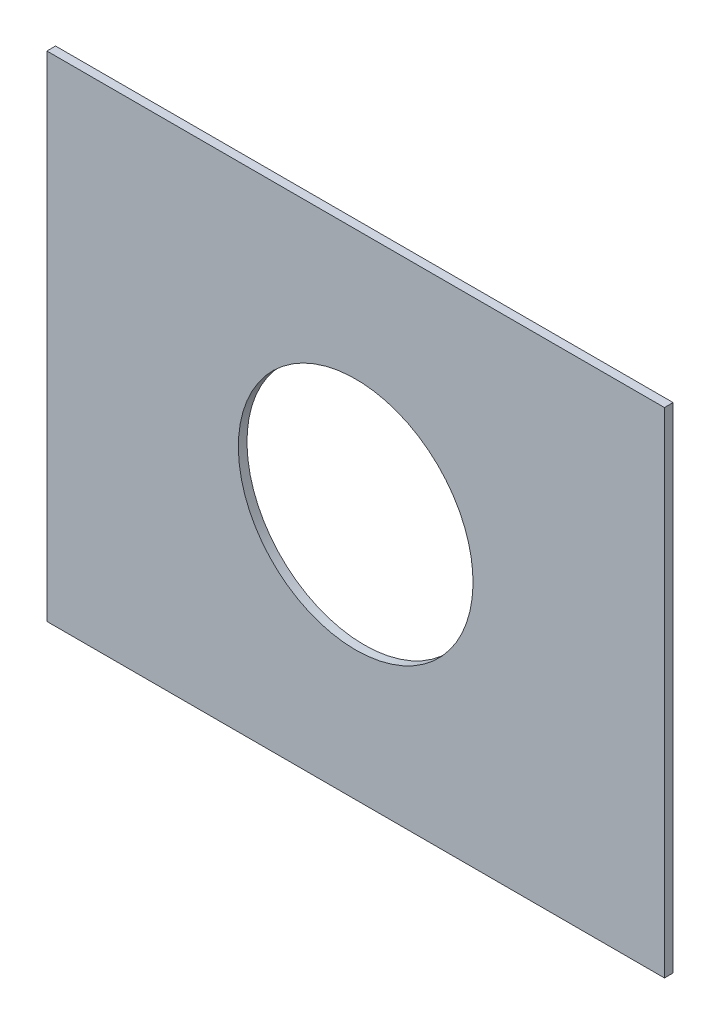
ISO-10303-21;
HEADER;
FILE_DESCRIPTION(('STEP AP214'),'2;1');
FILE_NAME('part.step','',(''),(''),'','','');
FILE_SCHEMA(('AUTOMOTIVE_DESIGN { 1 0 10303 214 1 1 1 1 }'));
ENDSEC;
DATA;
#1=APPLICATION_CONTEXT('core data for automotive mechanical design processes');
#2=APPLICATION_PROTOCOL_DEFINITION('international standard','automotive_design',2000,#1);
#3=PRODUCT_CONTEXT('',#1,'mechanical');
#4=PRODUCT('Part','Part','',(#3));
#5=PRODUCT_RELATED_PRODUCT_CATEGORY('part','',(#4));
#6=PRODUCT_DEFINITION_FORMATION('','',#4);
#7=PRODUCT_DEFINITION_CONTEXT('part definition',#1,'design');
#8=PRODUCT_DEFINITION('design','',#6,#7);
#9=PRODUCT_DEFINITION_SHAPE('','',#8);
#10=(LENGTH_UNIT() NAMED_UNIT(*) SI_UNIT(.MILLI.,.METRE.));
#11=(NAMED_UNIT(*) PLANE_ANGLE_UNIT() SI_UNIT($,.RADIAN.));
#12=(NAMED_UNIT(*) SI_UNIT($,.STERADIAN.) SOLID_ANGLE_UNIT());
#13=UNCERTAINTY_MEASURE_WITH_UNIT(LENGTH_MEASURE(1.E-05),#10,'distance_accuracy_value','');
#14=(GEOMETRIC_REPRESENTATION_CONTEXT(3) GLOBAL_UNCERTAINTY_ASSIGNED_CONTEXT((#13)) GLOBAL_UNIT_ASSIGNED_CONTEXT((#10,
#11,#12)) REPRESENTATION_CONTEXT('',''));
#15=CARTESIAN_POINT('',(0.,0.,0.));
#16=DIRECTION('',(0.,0.,1.));
#17=DIRECTION('',(1.,0.,0.));
#18=AXIS2_PLACEMENT_3D('',#15,#16,#17);
#19=CARTESIAN_POINT('',(113.792,-122.169,-0.045));
#20=DIRECTION('',(0.,0.,-1.));
#21=DIRECTION('',(0.,-1.,0.));
#22=AXIS2_PLACEMENT_3D('',#19,#20,#21);
#23=CYLINDRICAL_SURFACE('',#22,0.475);
#24=CARTESIAN_POINT('',(113.792,-122.169,-0.035));
#25=DIRECTION('',(0.,0.,-1.));
#26=DIRECTION('',(0.,-1.,0.));
#27=AXIS2_PLACEMENT_3D('',#24,#25,#26);
#28=CIRCLE('',#27,0.475);
#29=CARTESIAN_POINT('',(113.792,-122.644,-0.035));
#30=VERTEX_POINT('',#29);
#31=EDGE_CURVE('E129',#30,#30,#28,.T.);
#32=ORIENTED_EDGE('',*,*,#31,.T.);
#33=DIRECTION('',(0.,0.,1.));
#34=VECTOR('',#33,1.);
#35=CARTESIAN_POINT('',(113.792,-122.644,-0.045));
#36=LINE('',#35,#34);
#37=CARTESIAN_POINT('',(113.792,-122.644,0.));
#38=VERTEX_POINT('',#37);
#39=EDGE_CURVE('E11',#30,#38,#36,.T.);
#40=ORIENTED_EDGE('',*,*,#39,.T.);
#41=CARTESIAN_POINT('',(113.792,-122.169,0.));
#42=DIRECTION('',(0.,0.,-1.));
#43=DIRECTION('',(0.,-1.,0.));
#44=AXIS2_PLACEMENT_3D('',#41,#42,#43);
#45=CIRCLE('',#44,0.475);
#46=EDGE_CURVE('E25',#38,#38,#45,.T.);
#47=ORIENTED_EDGE('',*,*,#46,.F.);
#48=ORIENTED_EDGE('',*,*,#39,.F.);
#49=EDGE_LOOP('',(#32,#40,#47,#48));
#50=FACE_BOUND('',#49,.T.);
#51=ADVANCED_FACE('F17',(#50),#23,.F.);
#52=CARTESIAN_POINT('',(112.542,-121.169,-0.035));
#53=DIRECTION('',(0.,1.,0.));
#54=DIRECTION('',(1.,0.,0.));
#55=AXIS2_PLACEMENT_3D('',#52,#53,#54);
#56=PLANE('',#55);
#57=DIRECTION('',(0.,0.,1.));
#58=VECTOR('',#57,1.);
#59=CARTESIAN_POINT('',(112.542,-121.169,-0.035));
#60=LINE('',#59,#58);
#61=CARTESIAN_POINT('',(112.542,-121.169,-0.035));
#62=VERTEX_POINT('',#61);
#63=CARTESIAN_POINT('',(112.542,-121.169,0.));
#64=VERTEX_POINT('',#63);
#65=EDGE_CURVE('E115',#62,#64,#60,.T.);
#66=ORIENTED_EDGE('',*,*,#65,.T.);
#67=DIRECTION('',(1.,0.,0.));
#68=VECTOR('',#67,1.);
#69=CARTESIAN_POINT('',(112.542,-121.169,0.));
#70=LINE('',#69,#68);
#71=CARTESIAN_POINT('',(115.042,-121.169,0.));
#72=VERTEX_POINT('',#71);
#73=EDGE_CURVE('E132',#64,#72,#70,.T.);
#74=ORIENTED_EDGE('',*,*,#73,.T.);
#75=DIRECTION('',(0.,0.,1.));
#76=VECTOR('',#75,1.);
#77=CARTESIAN_POINT('',(115.042,-121.169,-0.035));
#78=LINE('',#77,#76);
#79=CARTESIAN_POINT('',(115.042,-121.169,-0.035));
#80=VERTEX_POINT('',#79);
#81=EDGE_CURVE('E98',#80,#72,#78,.T.);
#82=ORIENTED_EDGE('',*,*,#81,.F.);
#83=DIRECTION('',(1.,0.,0.));
#84=VECTOR('',#83,1.);
#85=CARTESIAN_POINT('',(112.542,-121.169,-0.035));
#86=LINE('',#85,#84);
#87=EDGE_CURVE('E81',#62,#80,#86,.T.);
#88=ORIENTED_EDGE('',*,*,#87,.F.);
#89=EDGE_LOOP('',(#66,#74,#82,#88));
#90=FACE_BOUND('',#89,.T.);
#91=ADVANCED_FACE('F142',(#90),#56,.T.);
#92=CARTESIAN_POINT('',(0.,0.,0.));
#93=DIRECTION('',(0.,0.,1.));
#94=DIRECTION('',(1.,0.,0.));
#95=AXIS2_PLACEMENT_3D('',#92,#93,#94);
#96=PLANE('',#95);
#97=ORIENTED_EDGE('',*,*,#46,.T.);
#98=EDGE_LOOP('',(#97));
#99=FACE_BOUND('',#98,.T.);
#100=DIRECTION('',(-1.,0.,0.));
#101=VECTOR('',#100,1.);
#102=CARTESIAN_POINT('',(115.042,-123.169,0.));
#103=LINE('',#102,#101);
#104=CARTESIAN_POINT('',(115.042,-123.169,0.));
#105=VERTEX_POINT('',#104);
#106=CARTESIAN_POINT('',(112.542,-123.169,0.));
#107=VERTEX_POINT('',#106);
#108=EDGE_CURVE('E104',#105,#107,#103,.T.);
#109=ORIENTED_EDGE('',*,*,#108,.F.);
#110=DIRECTION('',(0.,-1.,0.));
#111=VECTOR('',#110,1.);
#112=CARTESIAN_POINT('',(115.042,-121.169,0.));
#113=LINE('',#112,#111);
#114=EDGE_CURVE('E88',#72,#105,#113,.T.);
#115=ORIENTED_EDGE('',*,*,#114,.F.);
#116=ORIENTED_EDGE('',*,*,#73,.F.);
#117=DIRECTION('',(0.,1.,0.));
#118=VECTOR('',#117,1.);
#119=CARTESIAN_POINT('',(112.542,-123.169,0.));
#120=LINE('',#119,#118);
#121=EDGE_CURVE('E87',#107,#64,#120,.T.);
#122=ORIENTED_EDGE('',*,*,#121,.F.);
#123=EDGE_LOOP('',(#109,#115,#116,#122));
#124=FACE_BOUND('',#123,.T.);
#125=ADVANCED_FACE('F138',(#99,#124),#96,.T.);
#126=CARTESIAN_POINT('',(0.,0.,-0.035));
#127=DIRECTION('',(0.,0.,1.));
#128=DIRECTION('',(1.,0.,0.));
#129=AXIS2_PLACEMENT_3D('',#126,#127,#128);
#130=PLANE('',#129);
#131=ORIENTED_EDGE('',*,*,#31,.F.);
#132=EDGE_LOOP('',(#131));
#133=FACE_BOUND('',#132,.T.);
#134=DIRECTION('',(0.,1.,0.));
#135=VECTOR('',#134,1.);
#136=CARTESIAN_POINT('',(112.542,-123.169,-0.035));
#137=LINE('',#136,#135);
#138=CARTESIAN_POINT('',(112.542,-123.169,-0.035));
#139=VERTEX_POINT('',#138);
#140=EDGE_CURVE('E121',#139,#62,#137,.T.);
#141=ORIENTED_EDGE('',*,*,#140,.T.);
#142=ORIENTED_EDGE('',*,*,#87,.T.);
#143=DIRECTION('',(0.,-1.,0.));
#144=VECTOR('',#143,1.);
#145=CARTESIAN_POINT('',(115.042,-121.169,-0.035));
#146=LINE('',#145,#144);
#147=CARTESIAN_POINT('',(115.042,-123.169,-0.035));
#148=VERTEX_POINT('',#147);
#149=EDGE_CURVE('E75',#80,#148,#146,.T.);
#150=ORIENTED_EDGE('',*,*,#149,.T.);
#151=DIRECTION('',(-1.,0.,0.));
#152=VECTOR('',#151,1.);
#153=CARTESIAN_POINT('',(115.042,-123.169,-0.035));
#154=LINE('',#153,#152);
#155=EDGE_CURVE('E79',#148,#139,#154,.T.);
#156=ORIENTED_EDGE('',*,*,#155,.T.);
#157=EDGE_LOOP('',(#141,#142,#150,#156));
#158=FACE_BOUND('',#157,.T.);
#159=ADVANCED_FACE('F78',(#133,#158),#130,.F.);
#160=CARTESIAN_POINT('',(112.542,-123.169,-0.035));
#161=DIRECTION('',(-1.,0.,0.));
#162=DIRECTION('',(0.,0.,1.));
#163=AXIS2_PLACEMENT_3D('',#160,#161,#162);
#164=PLANE('',#163);
#165=DIRECTION('',(0.,0.,1.));
#166=VECTOR('',#165,1.);
#167=CARTESIAN_POINT('',(112.542,-123.169,-0.035));
#168=LINE('',#167,#166);
#169=EDGE_CURVE('E96',#139,#107,#168,.T.);
#170=ORIENTED_EDGE('',*,*,#169,.T.);
#171=ORIENTED_EDGE('',*,*,#121,.T.);
#172=ORIENTED_EDGE('',*,*,#65,.F.);
#173=ORIENTED_EDGE('',*,*,#140,.F.);
#174=EDGE_LOOP('',(#170,#171,#172,#173));
#175=FACE_BOUND('',#174,.T.);
#176=ADVANCED_FACE('F156',(#175),#164,.T.);
#177=CARTESIAN_POINT('',(115.042,-121.169,-0.035));
#178=DIRECTION('',(1.,0.,0.));
#179=DIRECTION('',(0.,1.,0.));
#180=AXIS2_PLACEMENT_3D('',#177,#178,#179);
#181=PLANE('',#180);
#182=ORIENTED_EDGE('',*,*,#81,.T.);
#183=ORIENTED_EDGE('',*,*,#114,.T.);
#184=DIRECTION('',(0.,0.,1.));
#185=VECTOR('',#184,1.);
#186=CARTESIAN_POINT('',(115.042,-123.169,-0.035));
#187=LINE('',#186,#185);
#188=EDGE_CURVE('E94',#148,#105,#187,.T.);
#189=ORIENTED_EDGE('',*,*,#188,.F.);
#190=ORIENTED_EDGE('',*,*,#149,.F.);
#191=EDGE_LOOP('',(#182,#183,#189,#190));
#192=FACE_BOUND('',#191,.T.);
#193=ADVANCED_FACE('F100',(#192),#181,.T.);
#194=CARTESIAN_POINT('',(115.042,-123.169,-0.035));
#195=DIRECTION('',(0.,-1.,0.));
#196=DIRECTION('',(0.,0.,-1.));
#197=AXIS2_PLACEMENT_3D('',#194,#195,#196);
#198=PLANE('',#197);
#199=ORIENTED_EDGE('',*,*,#188,.T.);
#200=ORIENTED_EDGE('',*,*,#108,.T.);
#201=ORIENTED_EDGE('',*,*,#169,.F.);
#202=ORIENTED_EDGE('',*,*,#155,.F.);
#203=EDGE_LOOP('',(#199,#200,#201,#202));
#204=FACE_BOUND('',#203,.T.);
#205=ADVANCED_FACE('F92',(#204),#198,.T.);
#206=CLOSED_SHELL('',(#51,#91,#125,#159,#176,#193,#205));
#207=MANIFOLD_SOLID_BREP('B1',#206);
#208=ADVANCED_BREP_SHAPE_REPRESENTATION('',(#18,#207),#14);
#209=SHAPE_DEFINITION_REPRESENTATION(#9,#208);
ENDSEC;
END-ISO-10303-21;
